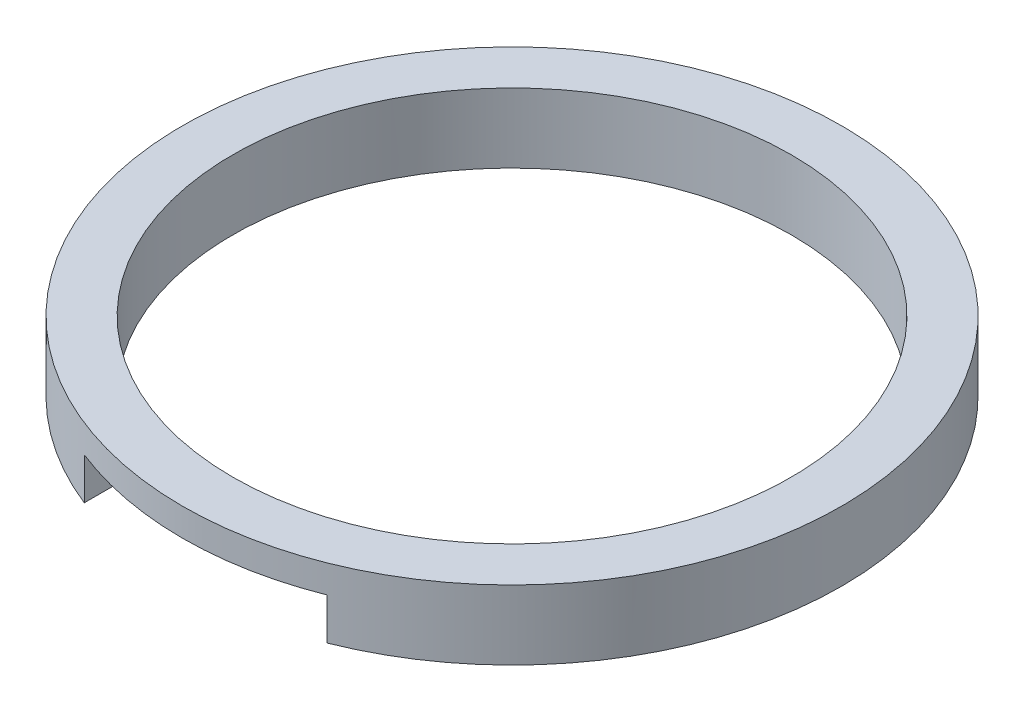
ISO-10303-21;
HEADER;
FILE_DESCRIPTION(('STEP AP214'),'2;1');
FILE_NAME('part.step','',(''),(''),'','','');
FILE_SCHEMA(('AUTOMOTIVE_DESIGN { 1 0 10303 214 1 1 1 1 }'));
ENDSEC;
DATA;
#1=APPLICATION_CONTEXT('core data for automotive mechanical design processes');
#2=APPLICATION_PROTOCOL_DEFINITION('international standard','automotive_design',2000,#1);
#3=PRODUCT_CONTEXT('',#1,'mechanical');
#4=PRODUCT('Part','Part','',(#3));
#5=PRODUCT_RELATED_PRODUCT_CATEGORY('part','',(#4));
#6=PRODUCT_DEFINITION_FORMATION('','',#4);
#7=PRODUCT_DEFINITION_CONTEXT('part definition',#1,'design');
#8=PRODUCT_DEFINITION('design','',#6,#7);
#9=PRODUCT_DEFINITION_SHAPE('','',#8);
#10=(LENGTH_UNIT() NAMED_UNIT(*) SI_UNIT(.MILLI.,.METRE.));
#11=(NAMED_UNIT(*) PLANE_ANGLE_UNIT() SI_UNIT($,.RADIAN.));
#12=(NAMED_UNIT(*) SI_UNIT($,.STERADIAN.) SOLID_ANGLE_UNIT());
#13=UNCERTAINTY_MEASURE_WITH_UNIT(LENGTH_MEASURE(1.E-05),#10,'distance_accuracy_value','');
#14=(GEOMETRIC_REPRESENTATION_CONTEXT(3) GLOBAL_UNCERTAINTY_ASSIGNED_CONTEXT((#13)) GLOBAL_UNIT_ASSIGNED_CONTEXT((#10,
#11,#12)) REPRESENTATION_CONTEXT('',''));
#15=CARTESIAN_POINT('',(0.,0.,0.));
#16=DIRECTION('',(0.,0.,1.));
#17=DIRECTION('',(1.,0.,0.));
#18=AXIS2_PLACEMENT_3D('',#15,#16,#17);
#19=CARTESIAN_POINT('',(0.,2.,0.));
#20=DIRECTION('',(0.,-1.,0.));
#21=DIRECTION('',(0.,0.,-1.));
#22=AXIS2_PLACEMENT_3D('',#19,#20,#21);
#23=CYLINDRICAL_SURFACE('',#22,9.5);
#24=CARTESIAN_POINT('',(0.,2.,0.));
#25=DIRECTION('',(0.,1.,0.));
#26=DIRECTION('',(0.,0.,1.));
#27=AXIS2_PLACEMENT_3D('',#24,#25,#26);
#28=CIRCLE('',#27,9.5);
#29=CARTESIAN_POINT('',(0.,2.,9.5));
#30=VERTEX_POINT('',#29);
#31=EDGE_CURVE('E13',#30,#30,#28,.T.);
#32=ORIENTED_EDGE('',*,*,#31,.F.);
#33=EDGE_LOOP('',(#32));
#34=FACE_BOUND('',#33,.T.);
#35=CARTESIAN_POINT('',(0.,1.2,0.));
#36=DIRECTION('',(0.,-1.,0.));
#37=DIRECTION('',(0.,0.,-1.));
#38=AXIS2_PLACEMENT_3D('',#35,#36,#37);
#39=CIRCLE('',#38,9.5);
#40=CARTESIAN_POINT('',(3.5,1.2,8.83176086632785));
#41=VERTEX_POINT('',#40);
#42=CARTESIAN_POINT('',(-3.5,1.2,8.83176086632785));
#43=VERTEX_POINT('',#42);
#44=EDGE_CURVE('E98',#41,#43,#39,.T.);
#45=ORIENTED_EDGE('',*,*,#44,.F.);
#46=DIRECTION('',(0.,-1.,0.));
#47=VECTOR('',#46,1.);
#48=CARTESIAN_POINT('',(3.5,1.2,8.83176086632785));
#49=LINE('',#48,#47);
#50=CARTESIAN_POINT('',(3.5,0.,8.83176086632785));
#51=VERTEX_POINT('',#50);
#52=EDGE_CURVE('E72',#41,#51,#49,.T.);
#53=ORIENTED_EDGE('',*,*,#52,.T.);
#54=CARTESIAN_POINT('',(0.,0.,0.));
#55=DIRECTION('',(0.,1.,0.));
#56=DIRECTION('',(0.,0.,1.));
#57=AXIS2_PLACEMENT_3D('',#54,#55,#56);
#58=CIRCLE('',#57,9.5);
#59=CARTESIAN_POINT('',(-3.5,0.,8.83176086632785));
#60=VERTEX_POINT('',#59);
#61=EDGE_CURVE('E52',#51,#60,#58,.T.);
#62=ORIENTED_EDGE('',*,*,#61,.T.);
#63=DIRECTION('',(0.,-1.,0.));
#64=VECTOR('',#63,1.);
#65=CARTESIAN_POINT('',(-3.5,1.2,8.83176086632785));
#66=LINE('',#65,#64);
#67=EDGE_CURVE('E92',#43,#60,#66,.T.);
#68=ORIENTED_EDGE('',*,*,#67,.F.);
#69=EDGE_LOOP('',(#45,#53,#62,#68));
#70=FACE_BOUND('',#69,.T.);
#71=ADVANCED_FACE('F49',(#34,#70),#23,.T.);
#72=CARTESIAN_POINT('',(0.,2.,0.));
#73=DIRECTION('',(0.,1.,0.));
#74=DIRECTION('',(0.,0.,1.));
#75=AXIS2_PLACEMENT_3D('',#72,#73,#74);
#76=PLANE('',#75);
#77=CARTESIAN_POINT('',(0.,2.,0.));
#78=DIRECTION('',(0.,1.,0.));
#79=DIRECTION('',(0.,0.,1.));
#80=AXIS2_PLACEMENT_3D('',#77,#78,#79);
#81=CIRCLE('',#80,8.05);
#82=CARTESIAN_POINT('',(0.,2.,8.05));
#83=VERTEX_POINT('',#82);
#84=EDGE_CURVE('E116',#83,#83,#81,.T.);
#85=ORIENTED_EDGE('',*,*,#84,.F.);
#86=EDGE_LOOP('',(#85));
#87=FACE_BOUND('',#86,.T.);
#88=ORIENTED_EDGE('',*,*,#31,.T.);
#89=EDGE_LOOP('',(#88));
#90=FACE_BOUND('',#89,.T.);
#91=ADVANCED_FACE('F133',(#87,#90),#76,.T.);
#92=CARTESIAN_POINT('',(0.,0.,0.));
#93=DIRECTION('',(0.,1.,0.));
#94=DIRECTION('',(0.,0.,1.));
#95=AXIS2_PLACEMENT_3D('',#92,#93,#94);
#96=PLANE('',#95);
#97=ORIENTED_EDGE('',*,*,#61,.F.);
#98=DIRECTION('',(0.,0.,1.));
#99=VECTOR('',#98,1.);
#100=CARTESIAN_POINT('',(3.5,0.,7.24931031202279));
#101=LINE('',#100,#99);
#102=CARTESIAN_POINT('',(3.5,0.,7.24931031202279));
#103=VERTEX_POINT('',#102);
#104=EDGE_CURVE('E88',#103,#51,#101,.T.);
#105=ORIENTED_EDGE('',*,*,#104,.F.);
#106=CARTESIAN_POINT('',(0.,0.,0.));
#107=DIRECTION('',(0.,1.,0.));
#108=DIRECTION('',(0.,0.,1.));
#109=AXIS2_PLACEMENT_3D('',#106,#107,#108);
#110=CIRCLE('',#109,8.05);
#111=CARTESIAN_POINT('',(-3.5,0.,7.24931031202279));
#112=VERTEX_POINT('',#111);
#113=EDGE_CURVE('E113',#103,#112,#110,.T.);
#114=ORIENTED_EDGE('',*,*,#113,.T.);
#115=DIRECTION('',(0.,0.,-1.));
#116=VECTOR('',#115,1.);
#117=CARTESIAN_POINT('',(-3.5,0.,7.24931031202279));
#118=LINE('',#117,#116);
#119=EDGE_CURVE('E123',#60,#112,#118,.T.);
#120=ORIENTED_EDGE('',*,*,#119,.F.);
#121=EDGE_LOOP('',(#97,#105,#114,#120));
#122=FACE_BOUND('',#121,.T.);
#123=ADVANCED_FACE('F131',(#122),#96,.F.);
#124=CARTESIAN_POINT('',(0.,0.,0.));
#125=DIRECTION('',(0.,1.,0.));
#126=DIRECTION('',(0.,0.,1.));
#127=AXIS2_PLACEMENT_3D('',#124,#125,#126);
#128=CYLINDRICAL_SURFACE('',#127,8.05);
#129=ORIENTED_EDGE('',*,*,#113,.F.);
#130=DIRECTION('',(0.,-1.,0.));
#131=VECTOR('',#130,1.);
#132=CARTESIAN_POINT('',(3.5,1.2,7.24931031202279));
#133=LINE('',#132,#131);
#134=CARTESIAN_POINT('',(3.5,1.2,7.24931031202279));
#135=VERTEX_POINT('',#134);
#136=EDGE_CURVE('E108',#135,#103,#133,.T.);
#137=ORIENTED_EDGE('',*,*,#136,.F.);
#138=CARTESIAN_POINT('',(0.,1.2,0.));
#139=DIRECTION('',(0.,1.,0.));
#140=DIRECTION('',(0.,0.,-1.));
#141=AXIS2_PLACEMENT_3D('',#138,#139,#140);
#142=CIRCLE('',#141,8.05);
#143=CARTESIAN_POINT('',(-3.5,1.2,7.24931031202279));
#144=VERTEX_POINT('',#143);
#145=EDGE_CURVE('E97',#144,#135,#142,.T.);
#146=ORIENTED_EDGE('',*,*,#145,.F.);
#147=DIRECTION('',(0.,-1.,0.));
#148=VECTOR('',#147,1.);
#149=CARTESIAN_POINT('',(-3.5,1.2,7.24931031202279));
#150=LINE('',#149,#148);
#151=EDGE_CURVE('E95',#144,#112,#150,.T.);
#152=ORIENTED_EDGE('',*,*,#151,.T.);
#153=EDGE_LOOP('',(#129,#137,#146,#152));
#154=FACE_BOUND('',#153,.T.);
#155=ORIENTED_EDGE('',*,*,#84,.T.);
#156=EDGE_LOOP('',(#155));
#157=FACE_BOUND('',#156,.T.);
#158=ADVANCED_FACE('F129',(#154,#157),#128,.F.);
#159=CARTESIAN_POINT('',(3.5,1.2,7.24931031202279));
#160=DIRECTION('',(1.,0.,0.));
#161=DIRECTION('',(0.,0.,-1.));
#162=AXIS2_PLACEMENT_3D('',#159,#160,#161);
#163=PLANE('',#162);
#164=ORIENTED_EDGE('',*,*,#104,.T.);
#165=ORIENTED_EDGE('',*,*,#52,.F.);
#166=DIRECTION('',(0.,0.,1.));
#167=VECTOR('',#166,1.);
#168=CARTESIAN_POINT('',(3.5,1.2,7.24931031202279));
#169=LINE('',#168,#167);
#170=EDGE_CURVE('E102',#135,#41,#169,.T.);
#171=ORIENTED_EDGE('',*,*,#170,.F.);
#172=ORIENTED_EDGE('',*,*,#136,.T.);
#173=EDGE_LOOP('',(#164,#165,#171,#172));
#174=FACE_BOUND('',#173,.T.);
#175=ADVANCED_FACE('F127',(#174),#163,.F.);
#176=CARTESIAN_POINT('',(-3.5,1.2,7.24931031202279));
#177=DIRECTION('',(-1.,0.,0.));
#178=DIRECTION('',(0.,0.,1.));
#179=AXIS2_PLACEMENT_3D('',#176,#177,#178);
#180=PLANE('',#179);
#181=ORIENTED_EDGE('',*,*,#119,.T.);
#182=ORIENTED_EDGE('',*,*,#151,.F.);
#183=DIRECTION('',(0.,0.,-1.));
#184=VECTOR('',#183,1.);
#185=CARTESIAN_POINT('',(-3.5,1.2,7.24931031202279));
#186=LINE('',#185,#184);
#187=EDGE_CURVE('E63',#43,#144,#186,.T.);
#188=ORIENTED_EDGE('',*,*,#187,.F.);
#189=ORIENTED_EDGE('',*,*,#67,.T.);
#190=EDGE_LOOP('',(#181,#182,#188,#189));
#191=FACE_BOUND('',#190,.T.);
#192=ADVANCED_FACE('F90',(#191),#180,.F.);
#193=CARTESIAN_POINT('',(0.,1.2,0.));
#194=DIRECTION('',(0.,-1.,0.));
#195=DIRECTION('',(0.,0.,-1.));
#196=AXIS2_PLACEMENT_3D('',#193,#194,#195);
#197=PLANE('',#196);
#198=ORIENTED_EDGE('',*,*,#44,.T.);
#199=ORIENTED_EDGE('',*,*,#187,.T.);
#200=ORIENTED_EDGE('',*,*,#145,.T.);
#201=ORIENTED_EDGE('',*,*,#170,.T.);
#202=EDGE_LOOP('',(#198,#199,#200,#201));
#203=FACE_BOUND('',#202,.T.);
#204=ADVANCED_FACE('F101',(#203),#197,.T.);
#205=CLOSED_SHELL('',(#71,#91,#123,#158,#175,#192,#204));
#206=MANIFOLD_SOLID_BREP('B2',#205);
#207=ADVANCED_BREP_SHAPE_REPRESENTATION('',(#18,#206),#14);
#208=SHAPE_DEFINITION_REPRESENTATION(#9,#207);
ENDSEC;
END-ISO-10303-21;
